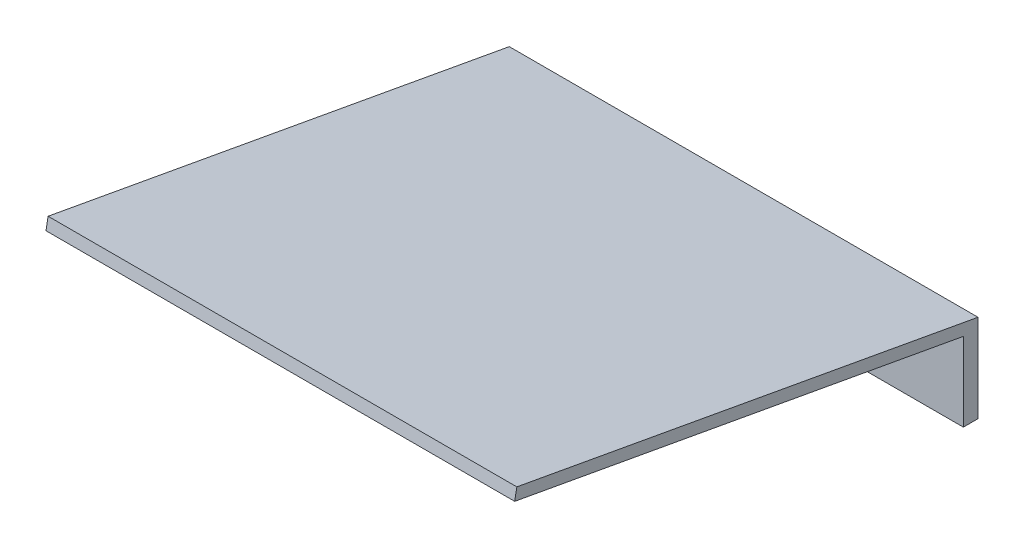
ISO-10303-21;
HEADER;
FILE_DESCRIPTION(('STEP AP214'),'2;1');
FILE_NAME('part.step','',(''),(''),'','','');
FILE_SCHEMA(('AUTOMOTIVE_DESIGN { 1 0 10303 214 1 1 1 1 }'));
ENDSEC;
DATA;
#1=APPLICATION_CONTEXT('core data for automotive mechanical design processes');
#2=APPLICATION_PROTOCOL_DEFINITION('international standard','automotive_design',2000,#1);
#3=PRODUCT_CONTEXT('',#1,'mechanical');
#4=PRODUCT('Part','Part','',(#3));
#5=PRODUCT_RELATED_PRODUCT_CATEGORY('part','',(#4));
#6=PRODUCT_DEFINITION_FORMATION('','',#4);
#7=PRODUCT_DEFINITION_CONTEXT('part definition',#1,'design');
#8=PRODUCT_DEFINITION('design','',#6,#7);
#9=PRODUCT_DEFINITION_SHAPE('','',#8);
#10=(LENGTH_UNIT() NAMED_UNIT(*) SI_UNIT(.MILLI.,.METRE.));
#11=(NAMED_UNIT(*) PLANE_ANGLE_UNIT() SI_UNIT($,.RADIAN.));
#12=(NAMED_UNIT(*) SI_UNIT($,.STERADIAN.) SOLID_ANGLE_UNIT());
#13=UNCERTAINTY_MEASURE_WITH_UNIT(LENGTH_MEASURE(1.E-05),#10,'distance_accuracy_value','');
#14=(GEOMETRIC_REPRESENTATION_CONTEXT(3) GLOBAL_UNCERTAINTY_ASSIGNED_CONTEXT((#13)) GLOBAL_UNIT_ASSIGNED_CONTEXT((#10,
#11,#12)) REPRESENTATION_CONTEXT('',''));
#15=CARTESIAN_POINT('',(0.,0.,0.));
#16=DIRECTION('',(0.,0.,1.));
#17=DIRECTION('',(1.,0.,0.));
#18=AXIS2_PLACEMENT_3D('',#15,#16,#17);
#19=CARTESIAN_POINT('',(80.,0.,1.25));
#20=DIRECTION('',(0.,-1.,0.));
#21=DIRECTION('',(0.,0.,-1.));
#22=AXIS2_PLACEMENT_3D('',#19,#20,#21);
#23=PLANE('',#22);
#24=DIRECTION('',(0.,0.,1.));
#25=VECTOR('',#24,1.);
#26=CARTESIAN_POINT('',(0.,0.,1.25));
#27=LINE('',#26,#25);
#28=CARTESIAN_POINT('',(0.,0.,0.));
#29=VERTEX_POINT('',#28);
#30=CARTESIAN_POINT('',(0.,0.,2.5));
#31=VERTEX_POINT('',#30);
#32=EDGE_CURVE('E12',#29,#31,#27,.T.);
#33=ORIENTED_EDGE('',*,*,#32,.F.);
#34=DIRECTION('',(-1.,0.,0.));
#35=VECTOR('',#34,1.);
#36=CARTESIAN_POINT('',(80.,0.,0.));
#37=LINE('',#36,#35);
#38=CARTESIAN_POINT('',(80.,0.,0.));
#39=VERTEX_POINT('',#38);
#40=EDGE_CURVE('E28',#39,#29,#37,.T.);
#41=ORIENTED_EDGE('',*,*,#40,.F.);
#42=DIRECTION('',(0.,0.,1.));
#43=VECTOR('',#42,1.);
#44=CARTESIAN_POINT('',(80.,0.,1.25));
#45=LINE('',#44,#43);
#46=CARTESIAN_POINT('',(80.,0.,2.5));
#47=VERTEX_POINT('',#46);
#48=EDGE_CURVE('E145',#39,#47,#45,.T.);
#49=ORIENTED_EDGE('',*,*,#48,.T.);
#50=DIRECTION('',(-1.,0.,0.));
#51=VECTOR('',#50,1.);
#52=CARTESIAN_POINT('',(80.,0.,2.5));
#53=LINE('',#52,#51);
#54=EDGE_CURVE('E86',#47,#31,#53,.T.);
#55=ORIENTED_EDGE('',*,*,#54,.T.);
#56=EDGE_LOOP('',(#33,#41,#49,#55));
#57=FACE_BOUND('',#56,.T.);
#58=ADVANCED_FACE('F19',(#57),#23,.T.);
#59=CARTESIAN_POINT('',(80.,7.5,0.));
#60=DIRECTION('',(0.,0.,-1.));
#61=DIRECTION('',(0.,1.,0.));
#62=AXIS2_PLACEMENT_3D('',#59,#60,#61);
#63=PLANE('',#62);
#64=DIRECTION('',(0.,-1.,0.));
#65=VECTOR('',#64,1.);
#66=CARTESIAN_POINT('',(0.,7.5,0.));
#67=LINE('',#66,#65);
#68=CARTESIAN_POINT('',(0.,15.,0.));
#69=VERTEX_POINT('',#68);
#70=EDGE_CURVE('E138',#69,#29,#67,.T.);
#71=ORIENTED_EDGE('',*,*,#70,.F.);
#72=DIRECTION('',(-1.,0.,0.));
#73=VECTOR('',#72,1.);
#74=CARTESIAN_POINT('',(80.,15.,0.));
#75=LINE('',#74,#73);
#76=CARTESIAN_POINT('',(80.,15.,0.));
#77=VERTEX_POINT('',#76);
#78=EDGE_CURVE('E134',#77,#69,#75,.T.);
#79=ORIENTED_EDGE('',*,*,#78,.F.);
#80=DIRECTION('',(0.,-1.,0.));
#81=VECTOR('',#80,1.);
#82=CARTESIAN_POINT('',(80.,7.5,0.));
#83=LINE('',#82,#81);
#84=EDGE_CURVE('E131',#77,#39,#83,.T.);
#85=ORIENTED_EDGE('',*,*,#84,.T.);
#86=ORIENTED_EDGE('',*,*,#40,.T.);
#87=EDGE_LOOP('',(#71,#79,#85,#86));
#88=FACE_BOUND('',#87,.T.);
#89=ADVANCED_FACE('F150',(#88),#63,.T.);
#90=CARTESIAN_POINT('',(80.,22.1425875036033,39.3571269753443));
#91=DIRECTION('',(0.,0.983928174383606,-0.178564687590082));
#92=DIRECTION('',(0.,0.178564687590082,0.983928174383606));
#93=AXIS2_PLACEMENT_3D('',#90,#91,#92);
#94=PLANE('',#93);
#95=DIRECTION('',(0.,-0.178564687590082,-0.983928174383606));
#96=VECTOR('',#95,1.);
#97=CARTESIAN_POINT('',(0.,22.1425875036033,39.3571269753443));
#98=LINE('',#97,#96);
#99=CARTESIAN_POINT('',(0.,29.2851750072066,78.7142539506886));
#100=VERTEX_POINT('',#99);
#101=EDGE_CURVE('E126',#100,#69,#98,.T.);
#102=ORIENTED_EDGE('',*,*,#101,.F.);
#103=DIRECTION('',(-1.,0.,0.));
#104=VECTOR('',#103,1.);
#105=CARTESIAN_POINT('',(80.,29.2851750072066,78.7142539506886));
#106=LINE('',#105,#104);
#107=CARTESIAN_POINT('',(80.,29.2851750072066,78.7142539506886));
#108=VERTEX_POINT('',#107);
#109=EDGE_CURVE('E123',#108,#100,#106,.T.);
#110=ORIENTED_EDGE('',*,*,#109,.F.);
#111=DIRECTION('',(0.,-0.178564687590082,-0.983928174383606));
#112=VECTOR('',#111,1.);
#113=CARTESIAN_POINT('',(80.,22.1425875036033,39.3571269753443));
#114=LINE('',#113,#112);
#115=EDGE_CURVE('E118',#108,#77,#114,.T.);
#116=ORIENTED_EDGE('',*,*,#115,.T.);
#117=ORIENTED_EDGE('',*,*,#78,.T.);
#118=EDGE_LOOP('',(#102,#110,#116,#117));
#119=FACE_BOUND('',#118,.T.);
#120=ADVANCED_FACE('F155',(#119),#94,.T.);
#121=CARTESIAN_POINT('',(80.,28.301246832823,78.8928186382786));
#122=DIRECTION('',(0.,0.178564687590081,0.983928174383607));
#123=DIRECTION('',(0.,-0.983928174383607,0.178564687590081));
#124=AXIS2_PLACEMENT_3D('',#121,#122,#123);
#125=PLANE('',#124);
#126=DIRECTION('',(0.,0.983928174383607,-0.178564687590081));
#127=VECTOR('',#126,1.);
#128=CARTESIAN_POINT('',(0.,28.301246832823,78.8928186382786));
#129=LINE('',#128,#127);
#130=CARTESIAN_POINT('',(0.,27.3173186584393,79.0713833258687));
#131=VERTEX_POINT('',#130);
#132=EDGE_CURVE('E113',#131,#100,#129,.T.);
#133=ORIENTED_EDGE('',*,*,#132,.F.);
#134=DIRECTION('',(-1.,0.,0.));
#135=VECTOR('',#134,1.);
#136=CARTESIAN_POINT('',(80.,27.3173186584393,79.0713833258687));
#137=LINE('',#136,#135);
#138=CARTESIAN_POINT('',(80.,27.3173186584393,79.0713833258687));
#139=VERTEX_POINT('',#138);
#140=EDGE_CURVE('E119',#139,#131,#137,.T.);
#141=ORIENTED_EDGE('',*,*,#140,.F.);
#142=DIRECTION('',(0.,0.983928174383607,-0.178564687590081));
#143=VECTOR('',#142,1.);
#144=CARTESIAN_POINT('',(80.,28.301246832823,78.8928186382786));
#145=LINE('',#144,#143);
#146=EDGE_CURVE('E95',#139,#108,#145,.T.);
#147=ORIENTED_EDGE('',*,*,#146,.T.);
#148=ORIENTED_EDGE('',*,*,#109,.T.);
#149=EDGE_LOOP('',(#133,#141,#147,#148));
#150=FACE_BOUND('',#149,.T.);
#151=ADVANCED_FACE('F157',(#150),#125,.T.);
#152=CARTESIAN_POINT('',(80.,20.3691767625689,40.7856916629344));
#153=DIRECTION('',(0.,-0.983928174383607,0.178564687590082));
#154=DIRECTION('',(0.,-0.178564687590082,-0.983928174383607));
#155=AXIS2_PLACEMENT_3D('',#152,#153,#154);
#156=PLANE('',#155);
#157=DIRECTION('',(0.,0.178564687590082,0.983928174383606));
#158=VECTOR('',#157,1.);
#159=CARTESIAN_POINT('',(0.,20.3691767625689,40.7856916629344));
#160=LINE('',#159,#158);
#161=CARTESIAN_POINT('',(0.,13.4210348666984,2.5));
#162=VERTEX_POINT('',#161);
#163=EDGE_CURVE('E76',#162,#131,#160,.T.);
#164=ORIENTED_EDGE('',*,*,#163,.F.);
#165=DIRECTION('',(-1.,0.,0.));
#166=VECTOR('',#165,1.);
#167=CARTESIAN_POINT('',(80.,13.4210348666984,2.5));
#168=LINE('',#167,#166);
#169=CARTESIAN_POINT('',(80.,13.4210348666984,2.5));
#170=VERTEX_POINT('',#169);
#171=EDGE_CURVE('E68',#170,#162,#168,.T.);
#172=ORIENTED_EDGE('',*,*,#171,.F.);
#173=DIRECTION('',(0.,0.178564687590082,0.983928174383606));
#174=VECTOR('',#173,1.);
#175=CARTESIAN_POINT('',(80.,20.3691767625689,40.7856916629344));
#176=LINE('',#175,#174);
#177=EDGE_CURVE('E73',#170,#139,#176,.T.);
#178=ORIENTED_EDGE('',*,*,#177,.T.);
#179=ORIENTED_EDGE('',*,*,#140,.T.);
#180=EDGE_LOOP('',(#164,#172,#178,#179));
#181=FACE_BOUND('',#180,.T.);
#182=ADVANCED_FACE('F70',(#181),#156,.T.);
#183=CARTESIAN_POINT('',(80.,6.71051743334921,2.5));
#184=DIRECTION('',(0.,0.,1.));
#185=DIRECTION('',(0.,-1.,0.));
#186=AXIS2_PLACEMENT_3D('',#183,#184,#185);
#187=PLANE('',#186);
#188=DIRECTION('',(0.,1.,0.));
#189=VECTOR('',#188,1.);
#190=CARTESIAN_POINT('',(0.,6.71051743334921,2.5));
#191=LINE('',#190,#189);
#192=EDGE_CURVE('E90',#31,#162,#191,.T.);
#193=ORIENTED_EDGE('',*,*,#192,.F.);
#194=ORIENTED_EDGE('',*,*,#54,.F.);
#195=DIRECTION('',(0.,1.,0.));
#196=VECTOR('',#195,1.);
#197=CARTESIAN_POINT('',(80.,6.71051743334921,2.5));
#198=LINE('',#197,#196);
#199=EDGE_CURVE('E84',#47,#170,#198,.T.);
#200=ORIENTED_EDGE('',*,*,#199,.T.);
#201=ORIENTED_EDGE('',*,*,#171,.T.);
#202=EDGE_LOOP('',(#193,#194,#200,#201));
#203=FACE_BOUND('',#202,.T.);
#204=ADVANCED_FACE('F85',(#203),#187,.T.);
#205=CARTESIAN_POINT('',(80.,14.6425875036033,39.5356916629344));
#206=DIRECTION('',(1.,0.,0.));
#207=DIRECTION('',(0.,0.,-1.));
#208=AXIS2_PLACEMENT_3D('',#205,#206,#207);
#209=PLANE('',#208);
#210=ORIENTED_EDGE('',*,*,#48,.F.);
#211=ORIENTED_EDGE('',*,*,#84,.F.);
#212=ORIENTED_EDGE('',*,*,#115,.F.);
#213=ORIENTED_EDGE('',*,*,#146,.F.);
#214=ORIENTED_EDGE('',*,*,#177,.F.);
#215=ORIENTED_EDGE('',*,*,#199,.F.);
#216=EDGE_LOOP('',(#210,#211,#212,#213,#214,#215));
#217=FACE_BOUND('',#216,.T.);
#218=ADVANCED_FACE('F92',(#217),#209,.T.);
#219=CARTESIAN_POINT('',(0.,14.6425875036033,39.5356916629344));
#220=DIRECTION('',(1.,0.,0.));
#221=DIRECTION('',(0.,0.,-1.));
#222=AXIS2_PLACEMENT_3D('',#219,#220,#221);
#223=PLANE('',#222);
#224=ORIENTED_EDGE('',*,*,#32,.T.);
#225=ORIENTED_EDGE('',*,*,#192,.T.);
#226=ORIENTED_EDGE('',*,*,#163,.T.);
#227=ORIENTED_EDGE('',*,*,#132,.T.);
#228=ORIENTED_EDGE('',*,*,#101,.T.);
#229=ORIENTED_EDGE('',*,*,#70,.T.);
#230=EDGE_LOOP('',(#224,#225,#226,#227,#228,#229));
#231=FACE_BOUND('',#230,.T.);
#232=ADVANCED_FACE('F153',(#231),#223,.F.);
#233=CLOSED_SHELL('',(#58,#89,#120,#151,#182,#204,#218,#232));
#234=MANIFOLD_SOLID_BREP('B1',#233);
#235=ADVANCED_BREP_SHAPE_REPRESENTATION('',(#18,#234),#14);
#236=SHAPE_DEFINITION_REPRESENTATION(#9,#235);
ENDSEC;
END-ISO-10303-21;
